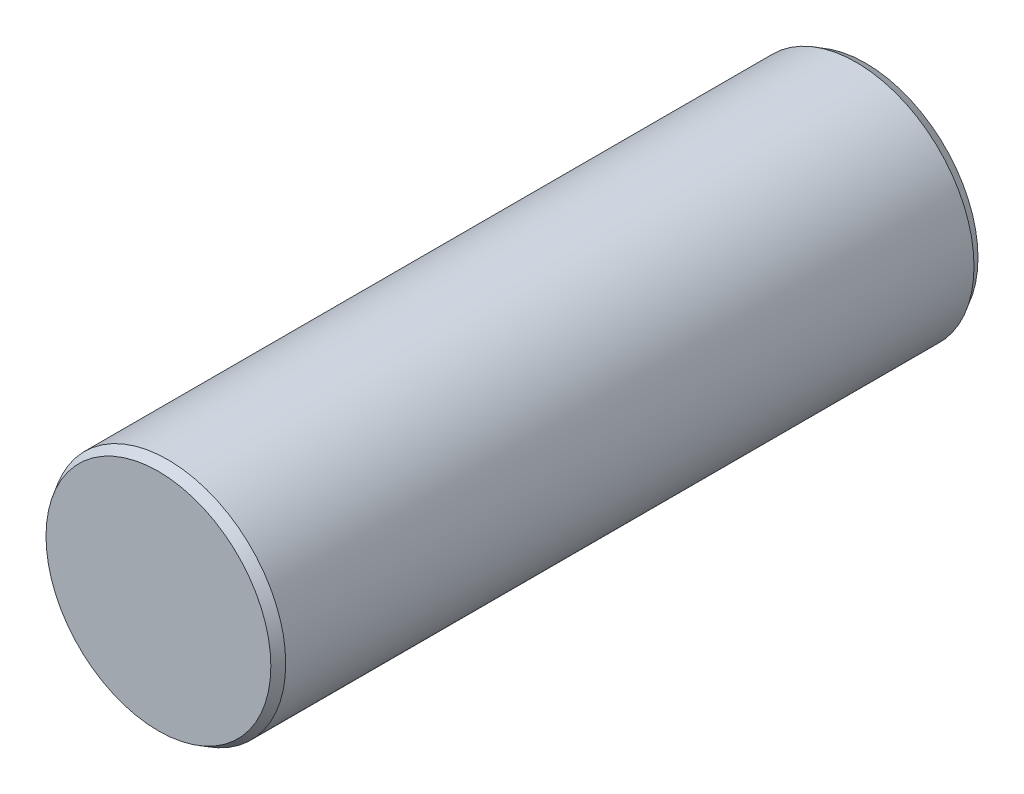
ISO-10303-21;
HEADER;
FILE_DESCRIPTION(('STEP AP214'),'2;1');
FILE_NAME('part.step','',(''),(''),'','','');
FILE_SCHEMA(('AUTOMOTIVE_DESIGN { 1 0 10303 214 1 1 1 1 }'));
ENDSEC;
DATA;
#1=APPLICATION_CONTEXT('core data for automotive mechanical design processes');
#2=APPLICATION_PROTOCOL_DEFINITION('international standard','automotive_design',2000,#1);
#3=PRODUCT_CONTEXT('',#1,'mechanical');
#4=PRODUCT('Part','Part','',(#3));
#5=PRODUCT_RELATED_PRODUCT_CATEGORY('part','',(#4));
#6=PRODUCT_DEFINITION_FORMATION('','',#4);
#7=PRODUCT_DEFINITION_CONTEXT('part definition',#1,'design');
#8=PRODUCT_DEFINITION('design','',#6,#7);
#9=PRODUCT_DEFINITION_SHAPE('','',#8);
#10=(LENGTH_UNIT() NAMED_UNIT(*) SI_UNIT(.MILLI.,.METRE.));
#11=(NAMED_UNIT(*) PLANE_ANGLE_UNIT() SI_UNIT($,.RADIAN.));
#12=(NAMED_UNIT(*) SI_UNIT($,.STERADIAN.) SOLID_ANGLE_UNIT());
#13=UNCERTAINTY_MEASURE_WITH_UNIT(LENGTH_MEASURE(1.E-05),#10,'distance_accuracy_value','');
#14=(GEOMETRIC_REPRESENTATION_CONTEXT(3) GLOBAL_UNCERTAINTY_ASSIGNED_CONTEXT((#13)) GLOBAL_UNIT_ASSIGNED_CONTEXT((#10,
#11,#12)) REPRESENTATION_CONTEXT('',''));
#15=CARTESIAN_POINT('',(0.,0.,0.));
#16=DIRECTION('',(0.,0.,1.));
#17=DIRECTION('',(1.,0.,0.));
#18=AXIS2_PLACEMENT_3D('',#15,#16,#17);
#19=CARTESIAN_POINT('',(0.,0.,7.5));
#20=DIRECTION('',(0.,0.,-1.));
#21=DIRECTION('',(-1.,0.,0.));
#22=AXIS2_PLACEMENT_3D('',#19,#20,#21);
#23=CYLINDRICAL_SURFACE('',#22,2.5);
#24=CARTESIAN_POINT('',(0.,0.,-7.29999999999999));
#25=DIRECTION('',(0.,0.,1.));
#26=DIRECTION('',(1.,0.,0.));
#27=AXIS2_PLACEMENT_3D('',#24,#25,#26);
#28=CIRCLE('',#27,2.5);
#29=CARTESIAN_POINT('',(2.5,0.,-7.29999999999999));
#30=VERTEX_POINT('',#29);
#31=EDGE_CURVE('E42',#30,#30,#28,.T.);
#32=ORIENTED_EDGE('',*,*,#31,.T.);
#33=EDGE_LOOP('',(#32));
#34=FACE_BOUND('',#33,.T.);
#35=CARTESIAN_POINT('',(0.,0.,7.29999999999999));
#36=DIRECTION('',(0.,0.,1.));
#37=DIRECTION('',(1.,0.,0.));
#38=AXIS2_PLACEMENT_3D('',#35,#36,#37);
#39=CIRCLE('',#38,2.5);
#40=CARTESIAN_POINT('',(2.5,0.,7.29999999999999));
#41=VERTEX_POINT('',#40);
#42=EDGE_CURVE('E46',#41,#41,#39,.F.);
#43=ORIENTED_EDGE('',*,*,#42,.T.);
#44=EDGE_LOOP('',(#43));
#45=FACE_BOUND('',#44,.T.);
#46=ADVANCED_FACE('F31',(#34,#45),#23,.T.);
#47=CARTESIAN_POINT('',(0.,0.,7.5));
#48=DIRECTION('',(0.,0.,1.));
#49=DIRECTION('',(1.,0.,0.));
#50=AXIS2_PLACEMENT_3D('',#47,#48,#49);
#51=PLANE('',#50);
#52=CARTESIAN_POINT('',(0.,0.,7.5));
#53=DIRECTION('',(0.,0.,1.));
#54=DIRECTION('',(1.,0.,0.));
#55=AXIS2_PLACEMENT_3D('',#52,#53,#54);
#56=CIRCLE('',#55,2.38452994616207);
#57=CARTESIAN_POINT('',(2.38452994616207,0.,7.5));
#58=VERTEX_POINT('',#57);
#59=EDGE_CURVE('E10',#58,#58,#56,.T.);
#60=ORIENTED_EDGE('',*,*,#59,.T.);
#61=EDGE_LOOP('',(#60));
#62=FACE_BOUND('',#61,.T.);
#63=ADVANCED_FACE('F62',(#62),#51,.T.);
#64=CARTESIAN_POINT('',(0.,0.,-7.5));
#65=DIRECTION('',(0.,0.,1.));
#66=DIRECTION('',(1.,0.,0.));
#67=AXIS2_PLACEMENT_3D('',#64,#65,#66);
#68=PLANE('',#67);
#69=CARTESIAN_POINT('',(0.,0.,-7.5));
#70=DIRECTION('',(0.,0.,1.));
#71=DIRECTION('',(1.,0.,0.));
#72=AXIS2_PLACEMENT_3D('',#69,#70,#71);
#73=CIRCLE('',#72,2.38452994616207);
#74=CARTESIAN_POINT('',(2.38452994616207,0.,-7.5));
#75=VERTEX_POINT('',#74);
#76=EDGE_CURVE('E38',#75,#75,#73,.F.);
#77=ORIENTED_EDGE('',*,*,#76,.T.);
#78=EDGE_LOOP('',(#77));
#79=FACE_BOUND('',#78,.T.);
#80=ADVANCED_FACE('F59',(#79),#68,.F.);
#81=CARTESIAN_POINT('',(0.,0.,-7.29999999999999));
#82=DIRECTION('',(0.,0.,1.));
#83=DIRECTION('',(1.,0.,0.));
#84=AXIS2_PLACEMENT_3D('',#81,#82,#83);
#85=CONICAL_SURFACE('',#84,2.5,0.523598775598297);
#86=ORIENTED_EDGE('',*,*,#76,.F.);
#87=EDGE_LOOP('',(#86));
#88=FACE_BOUND('',#87,.T.);
#89=ORIENTED_EDGE('',*,*,#31,.F.);
#90=EDGE_LOOP('',(#89));
#91=FACE_BOUND('',#90,.T.);
#92=ADVANCED_FACE('F55',(#88,#91),#85,.T.);
#93=CARTESIAN_POINT('',(0.,0.,7.5));
#94=DIRECTION('',(0.,0.,-1.));
#95=DIRECTION('',(-1.,0.,0.));
#96=AXIS2_PLACEMENT_3D('',#93,#94,#95);
#97=CONICAL_SURFACE('',#96,2.38452994616207,0.523598775598298);
#98=ORIENTED_EDGE('',*,*,#42,.F.);
#99=EDGE_LOOP('',(#98));
#100=FACE_BOUND('',#99,.T.);
#101=ORIENTED_EDGE('',*,*,#59,.F.);
#102=EDGE_LOOP('',(#101));
#103=FACE_BOUND('',#102,.T.);
#104=ADVANCED_FACE('F33',(#100,#103),#97,.T.);
#105=CLOSED_SHELL('',(#46,#63,#80,#92,#104));
#106=MANIFOLD_SOLID_BREP('B2',#105);
#107=ADVANCED_BREP_SHAPE_REPRESENTATION('',(#18,#106),#14);
#108=SHAPE_DEFINITION_REPRESENTATION(#9,#107);
ENDSEC;
END-ISO-10303-21;
